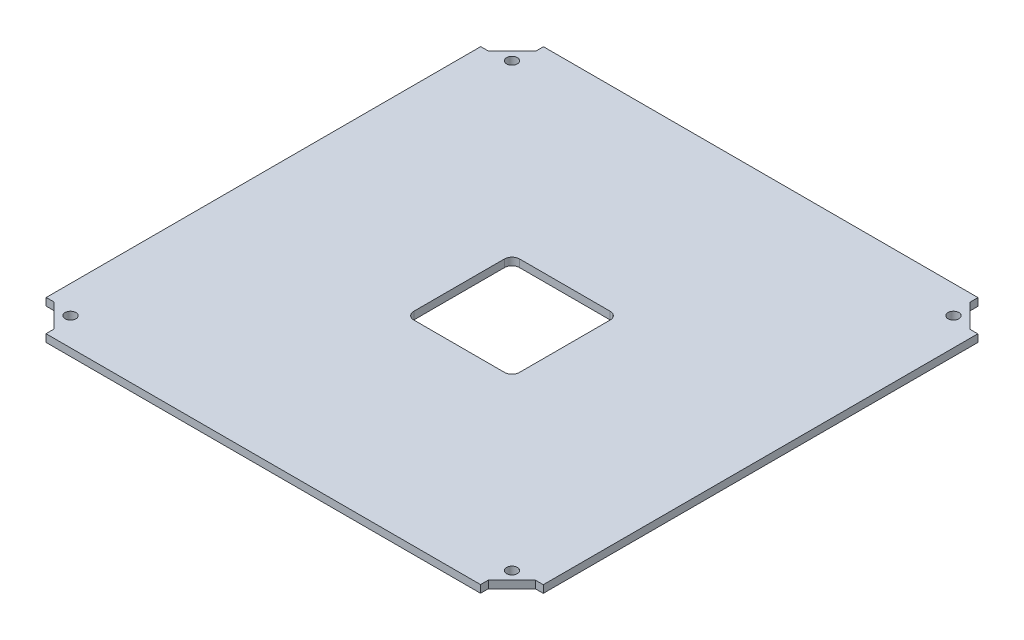
ISO-10303-21;
HEADER;
FILE_DESCRIPTION(('STEP AP214'),'2;1');
FILE_NAME('part.step','',(''),(''),'','','');
FILE_SCHEMA(('AUTOMOTIVE_DESIGN { 1 0 10303 214 1 1 1 1 }'));
ENDSEC;
DATA;
#1=APPLICATION_CONTEXT('core data for automotive mechanical design processes');
#2=APPLICATION_PROTOCOL_DEFINITION('international standard','automotive_design',2000,#1);
#3=PRODUCT_CONTEXT('',#1,'mechanical');
#4=PRODUCT('Part','Part','',(#3));
#5=PRODUCT_RELATED_PRODUCT_CATEGORY('part','',(#4));
#6=PRODUCT_DEFINITION_FORMATION('','',#4);
#7=PRODUCT_DEFINITION_CONTEXT('part definition',#1,'design');
#8=PRODUCT_DEFINITION('design','',#6,#7);
#9=PRODUCT_DEFINITION_SHAPE('','',#8);
#10=(LENGTH_UNIT() NAMED_UNIT(*) SI_UNIT(.MILLI.,.METRE.));
#11=(NAMED_UNIT(*) PLANE_ANGLE_UNIT() SI_UNIT($,.RADIAN.));
#12=(NAMED_UNIT(*) SI_UNIT($,.STERADIAN.) SOLID_ANGLE_UNIT());
#13=UNCERTAINTY_MEASURE_WITH_UNIT(LENGTH_MEASURE(1.E-05),#10,'distance_accuracy_value','');
#14=(GEOMETRIC_REPRESENTATION_CONTEXT(3) GLOBAL_UNCERTAINTY_ASSIGNED_CONTEXT((#13)) GLOBAL_UNIT_ASSIGNED_CONTEXT((#10,
#11,#12)) REPRESENTATION_CONTEXT('',''));
#15=CARTESIAN_POINT('',(0.,0.,0.));
#16=DIRECTION('',(0.,0.,1.));
#17=DIRECTION('',(1.,0.,0.));
#18=AXIS2_PLACEMENT_3D('',#15,#16,#17);
#19=CARTESIAN_POINT('',(0.,3.175,0.));
#20=DIRECTION('',(0.,1.,0.));
#21=DIRECTION('',(0.,0.,1.));
#22=AXIS2_PLACEMENT_3D('',#19,#20,#21);
#23=PLANE('',#22);
#24=CARTESIAN_POINT('',(-92.73413,3.175,92.73413));
#25=DIRECTION('',(0.,1.,0.));
#26=DIRECTION('',(0.,0.,1.));
#27=AXIS2_PLACEMENT_3D('',#24,#25,#26);
#28=CIRCLE('',#27,2.28599999999999);
#29=CARTESIAN_POINT('',(-92.73413,3.175,95.02013));
#30=VERTEX_POINT('',#29);
#31=EDGE_CURVE('E341',#30,#30,#28,.T.);
#32=ORIENTED_EDGE('',*,*,#31,.F.);
#33=EDGE_LOOP('',(#32));
#34=FACE_BOUND('',#33,.T.);
#35=CARTESIAN_POINT('',(92.73413,3.175,92.73413));
#36=DIRECTION('',(0.,1.,0.));
#37=DIRECTION('',(0.,0.,1.));
#38=AXIS2_PLACEMENT_3D('',#35,#36,#37);
#39=CIRCLE('',#38,2.28599999999999);
#40=CARTESIAN_POINT('',(92.73413,3.175,95.02013));
#41=VERTEX_POINT('',#40);
#42=EDGE_CURVE('E332',#41,#41,#39,.T.);
#43=ORIENTED_EDGE('',*,*,#42,.F.);
#44=EDGE_LOOP('',(#43));
#45=FACE_BOUND('',#44,.T.);
#46=CARTESIAN_POINT('',(92.73413,3.175,-92.73413));
#47=DIRECTION('',(0.,1.,0.));
#48=DIRECTION('',(0.,0.,1.));
#49=AXIS2_PLACEMENT_3D('',#46,#47,#48);
#50=CIRCLE('',#49,2.28599999999999);
#51=CARTESIAN_POINT('',(92.73413,3.175,-90.44813));
#52=VERTEX_POINT('',#51);
#53=EDGE_CURVE('E331',#52,#52,#50,.T.);
#54=ORIENTED_EDGE('',*,*,#53,.F.);
#55=EDGE_LOOP('',(#54));
#56=FACE_BOUND('',#55,.T.);
#57=CARTESIAN_POINT('',(-92.73413,3.175,-92.73413));
#58=DIRECTION('',(0.,1.,0.));
#59=DIRECTION('',(0.,0.,1.));
#60=AXIS2_PLACEMENT_3D('',#57,#58,#59);
#61=CIRCLE('',#60,2.28599999999999);
#62=CARTESIAN_POINT('',(-92.73413,3.175,-90.44813));
#63=VERTEX_POINT('',#62);
#64=EDGE_CURVE('E336',#63,#63,#61,.T.);
#65=ORIENTED_EDGE('',*,*,#64,.F.);
#66=EDGE_LOOP('',(#65));
#67=FACE_BOUND('',#66,.T.);
#68=DIRECTION('',(1.,0.,0.));
#69=VECTOR('',#68,1.);
#70=CARTESIAN_POINT('',(0.,3.175,91.2332677458592));
#71=LINE('',#70,#69);
#72=CARTESIAN_POINT('',(-104.4575,3.175,91.2332677458592));
#73=VERTEX_POINT('',#72);
#74=CARTESIAN_POINT('',(-101.1555,3.175,91.2332677458592));
#75=VERTEX_POINT('',#74);
#76=EDGE_CURVE('E216',#73,#75,#71,.T.);
#77=ORIENTED_EDGE('',*,*,#76,.T.);
#78=DIRECTION('',(0.703946656504847,0.,0.710252845679373));
#79=VECTOR('',#78,1.);
#80=CARTESIAN_POINT('',(-96.6436327647906,3.175,95.7855537941316));
#81=LINE('',#80,#79);
#82=CARTESIAN_POINT('',(-91.3213652086273,3.175,101.1555));
#83=VERTEX_POINT('',#82);
#84=EDGE_CURVE('E203',#75,#83,#81,.T.);
#85=ORIENTED_EDGE('',*,*,#84,.T.);
#86=DIRECTION('',(0.,0.,-1.));
#87=VECTOR('',#86,1.);
#88=CARTESIAN_POINT('',(-91.3213652086273,3.175,0.));
#89=LINE('',#88,#87);
#90=CARTESIAN_POINT('',(-91.3213652086273,3.175,104.4575));
#91=VERTEX_POINT('',#90);
#92=EDGE_CURVE('E215',#91,#83,#89,.T.);
#93=ORIENTED_EDGE('',*,*,#92,.F.);
#94=DIRECTION('',(1.,0.,0.));
#95=VECTOR('',#94,1.);
#96=CARTESIAN_POINT('',(0.,3.175,104.4575));
#97=LINE('',#96,#95);
#98=CARTESIAN_POINT('',(91.2332677458592,3.175,104.4575));
#99=VERTEX_POINT('',#98);
#100=EDGE_CURVE('E360',#91,#99,#97,.T.);
#101=ORIENTED_EDGE('',*,*,#100,.T.);
#102=DIRECTION('',(0.,0.,-1.));
#103=VECTOR('',#102,1.);
#104=CARTESIAN_POINT('',(91.2332677458592,3.175,0.));
#105=LINE('',#104,#103);
#106=CARTESIAN_POINT('',(91.2332677458592,3.175,101.1555));
#107=VERTEX_POINT('',#106);
#108=EDGE_CURVE('E363',#99,#107,#105,.T.);
#109=ORIENTED_EDGE('',*,*,#108,.T.);
#110=DIRECTION('',(0.710252845679373,0.,-0.703946656504847));
#111=VECTOR('',#110,1.);
#112=CARTESIAN_POINT('',(95.7855537941315,3.175,96.6436327647906));
#113=LINE('',#112,#111);
#114=CARTESIAN_POINT('',(101.1555,3.175,91.3213652086273));
#115=VERTEX_POINT('',#114);
#116=EDGE_CURVE('E366',#107,#115,#113,.T.);
#117=ORIENTED_EDGE('',*,*,#116,.T.);
#118=DIRECTION('',(-1.,0.,0.));
#119=VECTOR('',#118,1.);
#120=CARTESIAN_POINT('',(0.,3.175,91.3213652086273));
#121=LINE('',#120,#119);
#122=CARTESIAN_POINT('',(104.4575,3.175,91.3213652086273));
#123=VERTEX_POINT('',#122);
#124=EDGE_CURVE('E369',#123,#115,#121,.T.);
#125=ORIENTED_EDGE('',*,*,#124,.F.);
#126=DIRECTION('',(0.,0.,-1.));
#127=VECTOR('',#126,1.);
#128=CARTESIAN_POINT('',(104.4575,3.175,0.));
#129=LINE('',#128,#127);
#130=CARTESIAN_POINT('',(104.4575,3.175,-91.2332677458592));
#131=VERTEX_POINT('',#130);
#132=EDGE_CURVE('E373',#123,#131,#129,.T.);
#133=ORIENTED_EDGE('',*,*,#132,.T.);
#134=DIRECTION('',(-1.,0.,0.));
#135=VECTOR('',#134,1.);
#136=CARTESIAN_POINT('',(0.,3.175,-91.2332677458592));
#137=LINE('',#136,#135);
#138=CARTESIAN_POINT('',(101.1555,3.175,-91.2332677458592));
#139=VERTEX_POINT('',#138);
#140=EDGE_CURVE('E376',#131,#139,#137,.T.);
#141=ORIENTED_EDGE('',*,*,#140,.T.);
#142=DIRECTION('',(0.703946656504847,0.,0.710252845679373));
#143=VECTOR('',#142,1.);
#144=CARTESIAN_POINT('',(96.6436327647906,3.175,-95.7855537941315));
#145=LINE('',#144,#143);
#146=CARTESIAN_POINT('',(91.3213652086273,3.175,-101.1555));
#147=VERTEX_POINT('',#146);
#148=EDGE_CURVE('E379',#147,#139,#145,.T.);
#149=ORIENTED_EDGE('',*,*,#148,.F.);
#150=DIRECTION('',(0.,0.,1.));
#151=VECTOR('',#150,1.);
#152=CARTESIAN_POINT('',(91.3213652086273,3.175,0.));
#153=LINE('',#152,#151);
#154=CARTESIAN_POINT('',(91.3213652086273,3.175,-104.4575));
#155=VERTEX_POINT('',#154);
#156=EDGE_CURVE('E383',#155,#147,#153,.T.);
#157=ORIENTED_EDGE('',*,*,#156,.F.);
#158=DIRECTION('',(1.,0.,0.));
#159=VECTOR('',#158,1.);
#160=CARTESIAN_POINT('',(0.,3.175,-104.4575));
#161=LINE('',#160,#159);
#162=CARTESIAN_POINT('',(-91.2332677458592,3.175,-104.4575));
#163=VERTEX_POINT('',#162);
#164=EDGE_CURVE('E387',#163,#155,#161,.T.);
#165=ORIENTED_EDGE('',*,*,#164,.F.);
#166=DIRECTION('',(0.,0.,1.));
#167=VECTOR('',#166,1.);
#168=CARTESIAN_POINT('',(-91.2332677458592,3.175,0.));
#169=LINE('',#168,#167);
#170=CARTESIAN_POINT('',(-91.2332677458592,3.175,-101.1555));
#171=VERTEX_POINT('',#170);
#172=EDGE_CURVE('E391',#163,#171,#169,.T.);
#173=ORIENTED_EDGE('',*,*,#172,.T.);
#174=DIRECTION('',(0.710252845679373,0.,-0.703946656504847));
#175=VECTOR('',#174,1.);
#176=CARTESIAN_POINT('',(-95.7855537941315,3.175,-96.6436327647906));
#177=LINE('',#176,#175);
#178=CARTESIAN_POINT('',(-101.1555,3.175,-91.3213652086273));
#179=VERTEX_POINT('',#178);
#180=EDGE_CURVE('E394',#179,#171,#177,.T.);
#181=ORIENTED_EDGE('',*,*,#180,.F.);
#182=DIRECTION('',(1.,0.,0.));
#183=VECTOR('',#182,1.);
#184=CARTESIAN_POINT('',(0.,3.175,-91.3213652086273));
#185=LINE('',#184,#183);
#186=CARTESIAN_POINT('',(-104.4575,3.175,-91.3213652086273));
#187=VERTEX_POINT('',#186);
#188=EDGE_CURVE('E398',#187,#179,#185,.T.);
#189=ORIENTED_EDGE('',*,*,#188,.F.);
#190=DIRECTION('',(0.,0.,-1.));
#191=VECTOR('',#190,1.);
#192=CARTESIAN_POINT('',(-104.4575,3.175,0.));
#193=LINE('',#192,#191);
#194=EDGE_CURVE('E223',#73,#187,#193,.T.);
#195=ORIENTED_EDGE('',*,*,#194,.F.);
#196=EDGE_LOOP('',(#77,#85,#93,#101,#109,#117,#125,#133,#141,#149,#157,#165,#173,#181,#189,#195));
#197=FACE_BOUND('',#196,.T.);
#198=DIRECTION('',(0.,0.,-1.));
#199=VECTOR('',#198,1.);
#200=CARTESIAN_POINT('',(22.225,3.175,0.));
#201=LINE('',#200,#199);
#202=CARTESIAN_POINT('',(22.225,3.175,19.05));
#203=VERTEX_POINT('',#202);
#204=CARTESIAN_POINT('',(22.225,3.175,-19.05));
#205=VERTEX_POINT('',#204);
#206=EDGE_CURVE('E286',#203,#205,#201,.T.);
#207=ORIENTED_EDGE('',*,*,#206,.F.);
#208=CARTESIAN_POINT('',(19.05,3.175,19.05));
#209=DIRECTION('',(0.,1.,0.));
#210=DIRECTION('',(0.,0.,1.));
#211=AXIS2_PLACEMENT_3D('',#208,#209,#210);
#212=CIRCLE('',#211,3.175);
#213=CARTESIAN_POINT('',(19.05,3.175,22.225));
#214=VERTEX_POINT('',#213);
#215=EDGE_CURVE('E49',#203,#214,#212,.F.);
#216=ORIENTED_EDGE('',*,*,#215,.T.);
#217=DIRECTION('',(-1.,0.,0.));
#218=VECTOR('',#217,1.);
#219=CARTESIAN_POINT('',(0.,3.175,22.225));
#220=LINE('',#219,#218);
#221=CARTESIAN_POINT('',(-19.05,3.175,22.225));
#222=VERTEX_POINT('',#221);
#223=EDGE_CURVE('E284',#214,#222,#220,.T.);
#224=ORIENTED_EDGE('',*,*,#223,.T.);
#225=CARTESIAN_POINT('',(-19.05,3.175,19.05));
#226=DIRECTION('',(0.,1.,0.));
#227=DIRECTION('',(0.,0.,1.));
#228=AXIS2_PLACEMENT_3D('',#225,#226,#227);
#229=CIRCLE('',#228,3.175);
#230=CARTESIAN_POINT('',(-22.225,3.175,19.05));
#231=VERTEX_POINT('',#230);
#232=EDGE_CURVE('E277',#222,#231,#229,.F.);
#233=ORIENTED_EDGE('',*,*,#232,.T.);
#234=DIRECTION('',(0.,0.,-1.));
#235=VECTOR('',#234,1.);
#236=CARTESIAN_POINT('',(-22.225,3.175,0.));
#237=LINE('',#236,#235);
#238=CARTESIAN_POINT('',(-22.225,3.175,-19.05));
#239=VERTEX_POINT('',#238);
#240=EDGE_CURVE('E292',#231,#239,#237,.T.);
#241=ORIENTED_EDGE('',*,*,#240,.T.);
#242=CARTESIAN_POINT('',(-19.05,3.175,-19.05));
#243=DIRECTION('',(0.,1.,0.));
#244=DIRECTION('',(0.,0.,1.));
#245=AXIS2_PLACEMENT_3D('',#242,#243,#244);
#246=CIRCLE('',#245,3.175);
#247=CARTESIAN_POINT('',(-19.05,3.175,-22.225));
#248=VERTEX_POINT('',#247);
#249=EDGE_CURVE('E271',#239,#248,#246,.F.);
#250=ORIENTED_EDGE('',*,*,#249,.T.);
#251=DIRECTION('',(-1.,0.,0.));
#252=VECTOR('',#251,1.);
#253=CARTESIAN_POINT('',(0.,3.175,-22.225));
#254=LINE('',#253,#252);
#255=CARTESIAN_POINT('',(19.05,3.175,-22.225));
#256=VERTEX_POINT('',#255);
#257=EDGE_CURVE('E320',#256,#248,#254,.T.);
#258=ORIENTED_EDGE('',*,*,#257,.F.);
#259=CARTESIAN_POINT('',(19.05,3.175,-19.05));
#260=DIRECTION('',(0.,1.,0.));
#261=DIRECTION('',(0.,0.,1.));
#262=AXIS2_PLACEMENT_3D('',#259,#260,#261);
#263=CIRCLE('',#262,3.175);
#264=EDGE_CURVE('E265',#256,#205,#263,.F.);
#265=ORIENTED_EDGE('',*,*,#264,.T.);
#266=EDGE_LOOP('',(#207,#216,#224,#233,#241,#250,#258,#265));
#267=FACE_BOUND('',#266,.T.);
#268=ADVANCED_FACE('F40',(#34,#45,#56,#67,#197,#267),#23,.T.);
#269=CARTESIAN_POINT('',(0.,0.,0.));
#270=DIRECTION('',(0.,1.,0.));
#271=DIRECTION('',(0.,0.,1.));
#272=AXIS2_PLACEMENT_3D('',#269,#270,#271);
#273=PLANE('',#272);
#274=DIRECTION('',(1.,0.,0.));
#275=VECTOR('',#274,1.);
#276=CARTESIAN_POINT('',(0.,0.,91.2332677458592));
#277=LINE('',#276,#275);
#278=CARTESIAN_POINT('',(-104.4575,0.,91.2332677458592));
#279=VERTEX_POINT('',#278);
#280=CARTESIAN_POINT('',(-101.1555,0.,91.2332677458592));
#281=VERTEX_POINT('',#280);
#282=EDGE_CURVE('E230',#279,#281,#277,.T.);
#283=ORIENTED_EDGE('',*,*,#282,.F.);
#284=DIRECTION('',(0.,0.,-1.));
#285=VECTOR('',#284,1.);
#286=CARTESIAN_POINT('',(-104.4575,0.,0.));
#287=LINE('',#286,#285);
#288=CARTESIAN_POINT('',(-104.4575,0.,-91.3213652086273));
#289=VERTEX_POINT('',#288);
#290=EDGE_CURVE('E226',#279,#289,#287,.T.);
#291=ORIENTED_EDGE('',*,*,#290,.T.);
#292=DIRECTION('',(1.,0.,0.));
#293=VECTOR('',#292,1.);
#294=CARTESIAN_POINT('',(0.,0.,-91.3213652086273));
#295=LINE('',#294,#293);
#296=CARTESIAN_POINT('',(-101.1555,0.,-91.3213652086273));
#297=VERTEX_POINT('',#296);
#298=EDGE_CURVE('E455',#289,#297,#295,.T.);
#299=ORIENTED_EDGE('',*,*,#298,.T.);
#300=DIRECTION('',(0.710252845679373,0.,-0.703946656504847));
#301=VECTOR('',#300,1.);
#302=CARTESIAN_POINT('',(-95.7855537941315,0.,-96.6436327647906));
#303=LINE('',#302,#301);
#304=CARTESIAN_POINT('',(-91.2332677458592,0.,-101.1555));
#305=VERTEX_POINT('',#304);
#306=EDGE_CURVE('E451',#297,#305,#303,.T.);
#307=ORIENTED_EDGE('',*,*,#306,.T.);
#308=DIRECTION('',(0.,0.,1.));
#309=VECTOR('',#308,1.);
#310=CARTESIAN_POINT('',(-91.2332677458592,0.,0.));
#311=LINE('',#310,#309);
#312=CARTESIAN_POINT('',(-91.2332677458592,0.,-104.4575));
#313=VERTEX_POINT('',#312);
#314=EDGE_CURVE('E447',#313,#305,#311,.T.);
#315=ORIENTED_EDGE('',*,*,#314,.F.);
#316=DIRECTION('',(1.,0.,0.));
#317=VECTOR('',#316,1.);
#318=CARTESIAN_POINT('',(0.,0.,-104.4575));
#319=LINE('',#318,#317);
#320=CARTESIAN_POINT('',(91.3213652086273,0.,-104.4575));
#321=VERTEX_POINT('',#320);
#322=EDGE_CURVE('E443',#313,#321,#319,.T.);
#323=ORIENTED_EDGE('',*,*,#322,.T.);
#324=DIRECTION('',(0.,0.,1.));
#325=VECTOR('',#324,1.);
#326=CARTESIAN_POINT('',(91.3213652086273,0.,0.));
#327=LINE('',#326,#325);
#328=CARTESIAN_POINT('',(91.3213652086273,0.,-101.1555));
#329=VERTEX_POINT('',#328);
#330=EDGE_CURVE('E439',#321,#329,#327,.T.);
#331=ORIENTED_EDGE('',*,*,#330,.T.);
#332=DIRECTION('',(0.703946656504847,0.,0.710252845679373));
#333=VECTOR('',#332,1.);
#334=CARTESIAN_POINT('',(96.6436327647906,0.,-95.7855537941315));
#335=LINE('',#334,#333);
#336=CARTESIAN_POINT('',(101.1555,0.,-91.2332677458592));
#337=VERTEX_POINT('',#336);
#338=EDGE_CURVE('E435',#329,#337,#335,.T.);
#339=ORIENTED_EDGE('',*,*,#338,.T.);
#340=DIRECTION('',(-1.,0.,0.));
#341=VECTOR('',#340,1.);
#342=CARTESIAN_POINT('',(0.,0.,-91.2332677458592));
#343=LINE('',#342,#341);
#344=CARTESIAN_POINT('',(104.4575,0.,-91.2332677458592));
#345=VERTEX_POINT('',#344);
#346=EDGE_CURVE('E431',#345,#337,#343,.T.);
#347=ORIENTED_EDGE('',*,*,#346,.F.);
#348=DIRECTION('',(0.,0.,-1.));
#349=VECTOR('',#348,1.);
#350=CARTESIAN_POINT('',(104.4575,0.,0.));
#351=LINE('',#350,#349);
#352=CARTESIAN_POINT('',(104.4575,0.,91.3213652086273));
#353=VERTEX_POINT('',#352);
#354=EDGE_CURVE('E428',#353,#345,#351,.T.);
#355=ORIENTED_EDGE('',*,*,#354,.F.);
#356=DIRECTION('',(-1.,0.,0.));
#357=VECTOR('',#356,1.);
#358=CARTESIAN_POINT('',(0.,0.,91.3213652086273));
#359=LINE('',#358,#357);
#360=CARTESIAN_POINT('',(101.1555,0.,91.3213652086273));
#361=VERTEX_POINT('',#360);
#362=EDGE_CURVE('E424',#353,#361,#359,.T.);
#363=ORIENTED_EDGE('',*,*,#362,.T.);
#364=DIRECTION('',(0.710252845679373,0.,-0.703946656504847));
#365=VECTOR('',#364,1.);
#366=CARTESIAN_POINT('',(95.7855537941315,0.,96.6436327647906));
#367=LINE('',#366,#365);
#368=CARTESIAN_POINT('',(91.2332677458592,0.,101.1555));
#369=VERTEX_POINT('',#368);
#370=EDGE_CURVE('E420',#369,#361,#367,.T.);
#371=ORIENTED_EDGE('',*,*,#370,.F.);
#372=DIRECTION('',(0.,0.,-1.));
#373=VECTOR('',#372,1.);
#374=CARTESIAN_POINT('',(91.2332677458592,0.,0.));
#375=LINE('',#374,#373);
#376=CARTESIAN_POINT('',(91.2332677458592,0.,104.4575));
#377=VERTEX_POINT('',#376);
#378=EDGE_CURVE('E417',#377,#369,#375,.T.);
#379=ORIENTED_EDGE('',*,*,#378,.F.);
#380=DIRECTION('',(1.,0.,0.));
#381=VECTOR('',#380,1.);
#382=CARTESIAN_POINT('',(0.,0.,104.4575));
#383=LINE('',#382,#381);
#384=CARTESIAN_POINT('',(-91.3213652086273,0.,104.4575));
#385=VERTEX_POINT('',#384);
#386=EDGE_CURVE('E414',#385,#377,#383,.T.);
#387=ORIENTED_EDGE('',*,*,#386,.F.);
#388=DIRECTION('',(0.,0.,-1.));
#389=VECTOR('',#388,1.);
#390=CARTESIAN_POINT('',(-91.3213652086273,0.,0.));
#391=LINE('',#390,#389);
#392=CARTESIAN_POINT('',(-91.3213652086273,0.,101.1555));
#393=VERTEX_POINT('',#392);
#394=EDGE_CURVE('E410',#385,#393,#391,.T.);
#395=ORIENTED_EDGE('',*,*,#394,.T.);
#396=DIRECTION('',(0.703946656504847,0.,0.710252845679373));
#397=VECTOR('',#396,1.);
#398=CARTESIAN_POINT('',(-96.6436327647906,0.,95.7855537941316));
#399=LINE('',#398,#397);
#400=EDGE_CURVE('E407',#281,#393,#399,.T.);
#401=ORIENTED_EDGE('',*,*,#400,.F.);
#402=EDGE_LOOP('',(#283,#291,#299,#307,#315,#323,#331,#339,#347,#355,#363,#371,#379,#387,#395,#401));
#403=FACE_BOUND('',#402,.T.);
#404=CARTESIAN_POINT('',(-92.73413,0.,-92.73413));
#405=DIRECTION('',(0.,1.,0.));
#406=DIRECTION('',(0.,0.,1.));
#407=AXIS2_PLACEMENT_3D('',#404,#405,#406);
#408=CIRCLE('',#407,2.28599999999999);
#409=CARTESIAN_POINT('',(-92.73413,0.,-90.44813));
#410=VERTEX_POINT('',#409);
#411=EDGE_CURVE('E354',#410,#410,#408,.F.);
#412=ORIENTED_EDGE('',*,*,#411,.F.);
#413=EDGE_LOOP('',(#412));
#414=FACE_BOUND('',#413,.T.);
#415=CARTESIAN_POINT('',(92.73413,0.,-92.73413));
#416=DIRECTION('',(0.,1.,0.));
#417=DIRECTION('',(0.,0.,1.));
#418=AXIS2_PLACEMENT_3D('',#415,#416,#417);
#419=CIRCLE('',#418,2.28599999999999);
#420=CARTESIAN_POINT('',(92.73413,0.,-90.44813));
#421=VERTEX_POINT('',#420);
#422=EDGE_CURVE('E327',#421,#421,#419,.F.);
#423=ORIENTED_EDGE('',*,*,#422,.F.);
#424=EDGE_LOOP('',(#423));
#425=FACE_BOUND('',#424,.T.);
#426=CARTESIAN_POINT('',(92.73413,0.,92.73413));
#427=DIRECTION('',(0.,1.,0.));
#428=DIRECTION('',(0.,0.,1.));
#429=AXIS2_PLACEMENT_3D('',#426,#427,#428);
#430=CIRCLE('',#429,2.28599999999999);
#431=CARTESIAN_POINT('',(92.73413,0.,95.02013));
#432=VERTEX_POINT('',#431);
#433=EDGE_CURVE('E337',#432,#432,#430,.F.);
#434=ORIENTED_EDGE('',*,*,#433,.F.);
#435=EDGE_LOOP('',(#434));
#436=FACE_BOUND('',#435,.T.);
#437=CARTESIAN_POINT('',(-92.73413,0.,92.73413));
#438=DIRECTION('',(0.,1.,0.));
#439=DIRECTION('',(0.,0.,1.));
#440=AXIS2_PLACEMENT_3D('',#437,#438,#439);
#441=CIRCLE('',#440,2.28599999999999);
#442=CARTESIAN_POINT('',(-92.73413,0.,95.02013));
#443=VERTEX_POINT('',#442);
#444=EDGE_CURVE('E326',#443,#443,#441,.F.);
#445=ORIENTED_EDGE('',*,*,#444,.F.);
#446=EDGE_LOOP('',(#445));
#447=FACE_BOUND('',#446,.T.);
#448=DIRECTION('',(1.,0.,0.));
#449=VECTOR('',#448,1.);
#450=CARTESIAN_POINT('',(0.,0.,-22.225));
#451=LINE('',#450,#449);
#452=CARTESIAN_POINT('',(-19.05,0.,-22.225));
#453=VERTEX_POINT('',#452);
#454=CARTESIAN_POINT('',(19.05,0.,-22.225));
#455=VERTEX_POINT('',#454);
#456=EDGE_CURVE('E306',#453,#455,#451,.T.);
#457=ORIENTED_EDGE('',*,*,#456,.F.);
#458=CARTESIAN_POINT('',(-19.05,0.,-19.05));
#459=DIRECTION('',(0.,1.,0.));
#460=DIRECTION('',(0.,0.,1.));
#461=AXIS2_PLACEMENT_3D('',#458,#459,#460);
#462=CIRCLE('',#461,3.175);
#463=CARTESIAN_POINT('',(-22.225,0.,-19.05));
#464=VERTEX_POINT('',#463);
#465=EDGE_CURVE('E274',#453,#464,#462,.T.);
#466=ORIENTED_EDGE('',*,*,#465,.T.);
#467=DIRECTION('',(0.,0.,1.));
#468=VECTOR('',#467,1.);
#469=CARTESIAN_POINT('',(-22.225,0.,0.));
#470=LINE('',#469,#468);
#471=CARTESIAN_POINT('',(-22.225,0.,19.05));
#472=VERTEX_POINT('',#471);
#473=EDGE_CURVE('E310',#464,#472,#470,.T.);
#474=ORIENTED_EDGE('',*,*,#473,.T.);
#475=CARTESIAN_POINT('',(-19.05,0.,19.05));
#476=DIRECTION('',(0.,1.,0.));
#477=DIRECTION('',(0.,0.,1.));
#478=AXIS2_PLACEMENT_3D('',#475,#476,#477);
#479=CIRCLE('',#478,3.175);
#480=CARTESIAN_POINT('',(-19.05,0.,22.225));
#481=VERTEX_POINT('',#480);
#482=EDGE_CURVE('E63',#472,#481,#479,.T.);
#483=ORIENTED_EDGE('',*,*,#482,.T.);
#484=DIRECTION('',(1.,0.,0.));
#485=VECTOR('',#484,1.);
#486=CARTESIAN_POINT('',(0.,0.,22.225));
#487=LINE('',#486,#485);
#488=CARTESIAN_POINT('',(19.05,0.,22.225));
#489=VERTEX_POINT('',#488);
#490=EDGE_CURVE('E301',#481,#489,#487,.T.);
#491=ORIENTED_EDGE('',*,*,#490,.T.);
#492=CARTESIAN_POINT('',(19.05,0.,19.05));
#493=DIRECTION('',(0.,1.,0.));
#494=DIRECTION('',(0.,0.,1.));
#495=AXIS2_PLACEMENT_3D('',#492,#493,#494);
#496=CIRCLE('',#495,3.175);
#497=CARTESIAN_POINT('',(22.225,0.,19.05));
#498=VERTEX_POINT('',#497);
#499=EDGE_CURVE('E11',#489,#498,#496,.T.);
#500=ORIENTED_EDGE('',*,*,#499,.T.);
#501=DIRECTION('',(0.,0.,1.));
#502=VECTOR('',#501,1.);
#503=CARTESIAN_POINT('',(22.225,0.,0.));
#504=LINE('',#503,#502);
#505=CARTESIAN_POINT('',(22.225,0.,-19.05));
#506=VERTEX_POINT('',#505);
#507=EDGE_CURVE('E299',#506,#498,#504,.T.);
#508=ORIENTED_EDGE('',*,*,#507,.F.);
#509=CARTESIAN_POINT('',(19.05,0.,-19.05));
#510=DIRECTION('',(0.,1.,0.));
#511=DIRECTION('',(0.,0.,1.));
#512=AXIS2_PLACEMENT_3D('',#509,#510,#511);
#513=CIRCLE('',#512,3.175);
#514=EDGE_CURVE('E268',#506,#455,#513,.T.);
#515=ORIENTED_EDGE('',*,*,#514,.T.);
#516=EDGE_LOOP('',(#457,#466,#474,#483,#491,#500,#508,#515));
#517=FACE_BOUND('',#516,.T.);
#518=ADVANCED_FACE('F298',(#403,#414,#425,#436,#447,#517),#273,.F.);
#519=CARTESIAN_POINT('',(0.,3.175,91.2332677458592));
#520=DIRECTION('',(0.,0.,-1.));
#521=DIRECTION('',(-1.,0.,0.));
#522=AXIS2_PLACEMENT_3D('',#519,#520,#521);
#523=PLANE('',#522);
#524=ORIENTED_EDGE('',*,*,#282,.T.);
#525=DIRECTION('',(0.,-1.,0.));
#526=VECTOR('',#525,1.);
#527=CARTESIAN_POINT('',(-101.1555,3.175,91.2332677458592));
#528=LINE('',#527,#526);
#529=EDGE_CURVE('E208',#75,#281,#528,.T.);
#530=ORIENTED_EDGE('',*,*,#529,.F.);
#531=ORIENTED_EDGE('',*,*,#76,.F.);
#532=DIRECTION('',(0.,-1.,0.));
#533=VECTOR('',#532,1.);
#534=CARTESIAN_POINT('',(-104.4575,3.175,91.2332677458592));
#535=LINE('',#534,#533);
#536=EDGE_CURVE('E404',#73,#279,#535,.T.);
#537=ORIENTED_EDGE('',*,*,#536,.T.);
#538=EDGE_LOOP('',(#524,#530,#531,#537));
#539=FACE_BOUND('',#538,.T.);
#540=ADVANCED_FACE('F228',(#539),#523,.F.);
#541=CARTESIAN_POINT('',(-96.6436327647906,3.175,95.7855537941316));
#542=DIRECTION('',(0.710252845679373,0.,-0.703946656504847));
#543=DIRECTION('',(-0.703946656504847,0.,-0.710252845679373));
#544=AXIS2_PLACEMENT_3D('',#541,#542,#543);
#545=PLANE('',#544);
#546=ORIENTED_EDGE('',*,*,#400,.T.);
#547=DIRECTION('',(0.,-1.,0.));
#548=VECTOR('',#547,1.);
#549=CARTESIAN_POINT('',(-91.3213652086273,3.175,101.1555));
#550=LINE('',#549,#548);
#551=EDGE_CURVE('E210',#83,#393,#550,.T.);
#552=ORIENTED_EDGE('',*,*,#551,.F.);
#553=ORIENTED_EDGE('',*,*,#84,.F.);
#554=ORIENTED_EDGE('',*,*,#529,.T.);
#555=EDGE_LOOP('',(#546,#552,#553,#554));
#556=FACE_BOUND('',#555,.T.);
#557=ADVANCED_FACE('F206',(#556),#545,.F.);
#558=CARTESIAN_POINT('',(-91.3213652086273,3.175,0.));
#559=DIRECTION('',(-1.,0.,0.));
#560=DIRECTION('',(0.,0.,1.));
#561=AXIS2_PLACEMENT_3D('',#558,#559,#560);
#562=PLANE('',#561);
#563=ORIENTED_EDGE('',*,*,#394,.F.);
#564=DIRECTION('',(0.,-1.,0.));
#565=VECTOR('',#564,1.);
#566=CARTESIAN_POINT('',(-91.3213652086273,3.175,104.4575));
#567=LINE('',#566,#565);
#568=EDGE_CURVE('E238',#91,#385,#567,.T.);
#569=ORIENTED_EDGE('',*,*,#568,.F.);
#570=ORIENTED_EDGE('',*,*,#92,.T.);
#571=ORIENTED_EDGE('',*,*,#551,.T.);
#572=EDGE_LOOP('',(#563,#569,#570,#571));
#573=FACE_BOUND('',#572,.T.);
#574=ADVANCED_FACE('F514',(#573),#562,.T.);
#575=CARTESIAN_POINT('',(0.,3.175,104.4575));
#576=DIRECTION('',(0.,0.,-1.));
#577=DIRECTION('',(-1.,0.,0.));
#578=AXIS2_PLACEMENT_3D('',#575,#576,#577);
#579=PLANE('',#578);
#580=ORIENTED_EDGE('',*,*,#386,.T.);
#581=DIRECTION('',(0.,-1.,0.));
#582=VECTOR('',#581,1.);
#583=CARTESIAN_POINT('',(91.2332677458592,3.175,104.4575));
#584=LINE('',#583,#582);
#585=EDGE_CURVE('E499',#99,#377,#584,.T.);
#586=ORIENTED_EDGE('',*,*,#585,.F.);
#587=ORIENTED_EDGE('',*,*,#100,.F.);
#588=ORIENTED_EDGE('',*,*,#568,.T.);
#589=EDGE_LOOP('',(#580,#586,#587,#588));
#590=FACE_BOUND('',#589,.T.);
#591=ADVANCED_FACE('F506',(#590),#579,.F.);
#592=CARTESIAN_POINT('',(91.2332677458592,3.175,0.));
#593=DIRECTION('',(-1.,0.,0.));
#594=DIRECTION('',(0.,0.,1.));
#595=AXIS2_PLACEMENT_3D('',#592,#593,#594);
#596=PLANE('',#595);
#597=ORIENTED_EDGE('',*,*,#378,.T.);
#598=DIRECTION('',(0.,-1.,0.));
#599=VECTOR('',#598,1.);
#600=CARTESIAN_POINT('',(91.2332677458592,3.175,101.1555));
#601=LINE('',#600,#599);
#602=EDGE_CURVE('E495',#107,#369,#601,.T.);
#603=ORIENTED_EDGE('',*,*,#602,.F.);
#604=ORIENTED_EDGE('',*,*,#108,.F.);
#605=ORIENTED_EDGE('',*,*,#585,.T.);
#606=EDGE_LOOP('',(#597,#603,#604,#605));
#607=FACE_BOUND('',#606,.T.);
#608=ADVANCED_FACE('F562',(#607),#596,.F.);
#609=CARTESIAN_POINT('',(95.7855537941315,3.175,96.6436327647906));
#610=DIRECTION('',(-0.703946656504847,0.,-0.710252845679373));
#611=DIRECTION('',(-0.710252845679373,0.,0.703946656504847));
#612=AXIS2_PLACEMENT_3D('',#609,#610,#611);
#613=PLANE('',#612);
#614=ORIENTED_EDGE('',*,*,#370,.T.);
#615=DIRECTION('',(0.,-1.,0.));
#616=VECTOR('',#615,1.);
#617=CARTESIAN_POINT('',(101.1555,3.175,91.3213652086273));
#618=LINE('',#617,#616);
#619=EDGE_CURVE('E492',#115,#361,#618,.T.);
#620=ORIENTED_EDGE('',*,*,#619,.F.);
#621=ORIENTED_EDGE('',*,*,#116,.F.);
#622=ORIENTED_EDGE('',*,*,#602,.T.);
#623=EDGE_LOOP('',(#614,#620,#621,#622));
#624=FACE_BOUND('',#623,.T.);
#625=ADVANCED_FACE('F558',(#624),#613,.F.);
#626=CARTESIAN_POINT('',(0.,3.175,91.3213652086273));
#627=DIRECTION('',(0.,0.,1.));
#628=DIRECTION('',(1.,0.,0.));
#629=AXIS2_PLACEMENT_3D('',#626,#627,#628);
#630=PLANE('',#629);
#631=ORIENTED_EDGE('',*,*,#362,.F.);
#632=DIRECTION('',(0.,-1.,0.));
#633=VECTOR('',#632,1.);
#634=CARTESIAN_POINT('',(104.4575,3.175,91.3213652086273));
#635=LINE('',#634,#633);
#636=EDGE_CURVE('E489',#123,#353,#635,.T.);
#637=ORIENTED_EDGE('',*,*,#636,.F.);
#638=ORIENTED_EDGE('',*,*,#124,.T.);
#639=ORIENTED_EDGE('',*,*,#619,.T.);
#640=EDGE_LOOP('',(#631,#637,#638,#639));
#641=FACE_BOUND('',#640,.T.);
#642=ADVANCED_FACE('F552',(#641),#630,.T.);
#643=CARTESIAN_POINT('',(104.4575,3.175,0.));
#644=DIRECTION('',(-1.,0.,0.));
#645=DIRECTION('',(0.,0.,1.));
#646=AXIS2_PLACEMENT_3D('',#643,#644,#645);
#647=PLANE('',#646);
#648=ORIENTED_EDGE('',*,*,#354,.T.);
#649=DIRECTION('',(0.,-1.,0.));
#650=VECTOR('',#649,1.);
#651=CARTESIAN_POINT('',(104.4575,3.175,-91.2332677458592));
#652=LINE('',#651,#650);
#653=EDGE_CURVE('E485',#131,#345,#652,.T.);
#654=ORIENTED_EDGE('',*,*,#653,.F.);
#655=ORIENTED_EDGE('',*,*,#132,.F.);
#656=ORIENTED_EDGE('',*,*,#636,.T.);
#657=EDGE_LOOP('',(#648,#654,#655,#656));
#658=FACE_BOUND('',#657,.T.);
#659=ADVANCED_FACE('F563',(#658),#647,.F.);
#660=CARTESIAN_POINT('',(0.,3.175,-91.2332677458592));
#661=DIRECTION('',(0.,0.,1.));
#662=DIRECTION('',(1.,0.,0.));
#663=AXIS2_PLACEMENT_3D('',#660,#661,#662);
#664=PLANE('',#663);
#665=ORIENTED_EDGE('',*,*,#346,.T.);
#666=DIRECTION('',(0.,-1.,0.));
#667=VECTOR('',#666,1.);
#668=CARTESIAN_POINT('',(101.1555,3.175,-91.2332677458592));
#669=LINE('',#668,#667);
#670=EDGE_CURVE('E482',#139,#337,#669,.T.);
#671=ORIENTED_EDGE('',*,*,#670,.F.);
#672=ORIENTED_EDGE('',*,*,#140,.F.);
#673=ORIENTED_EDGE('',*,*,#653,.T.);
#674=EDGE_LOOP('',(#665,#671,#672,#673));
#675=FACE_BOUND('',#674,.T.);
#676=ADVANCED_FACE('F546',(#675),#664,.F.);
#677=CARTESIAN_POINT('',(96.6436327647906,3.175,-95.7855537941315));
#678=DIRECTION('',(0.710252845679373,0.,-0.703946656504847));
#679=DIRECTION('',(-0.703946656504847,0.,-0.710252845679373));
#680=AXIS2_PLACEMENT_3D('',#677,#678,#679);
#681=PLANE('',#680);
#682=ORIENTED_EDGE('',*,*,#338,.F.);
#683=DIRECTION('',(0.,-1.,0.));
#684=VECTOR('',#683,1.);
#685=CARTESIAN_POINT('',(91.3213652086273,3.175,-101.1555));
#686=LINE('',#685,#684);
#687=EDGE_CURVE('E479',#147,#329,#686,.T.);
#688=ORIENTED_EDGE('',*,*,#687,.F.);
#689=ORIENTED_EDGE('',*,*,#148,.T.);
#690=ORIENTED_EDGE('',*,*,#670,.T.);
#691=EDGE_LOOP('',(#682,#688,#689,#690));
#692=FACE_BOUND('',#691,.T.);
#693=ADVANCED_FACE('F542',(#692),#681,.T.);
#694=CARTESIAN_POINT('',(91.3213652086273,3.175,0.));
#695=DIRECTION('',(1.,0.,0.));
#696=DIRECTION('',(0.,0.,-1.));
#697=AXIS2_PLACEMENT_3D('',#694,#695,#696);
#698=PLANE('',#697);
#699=ORIENTED_EDGE('',*,*,#330,.F.);
#700=DIRECTION('',(0.,-1.,0.));
#701=VECTOR('',#700,1.);
#702=CARTESIAN_POINT('',(91.3213652086273,3.175,-104.4575));
#703=LINE('',#702,#701);
#704=EDGE_CURVE('E476',#155,#321,#703,.T.);
#705=ORIENTED_EDGE('',*,*,#704,.F.);
#706=ORIENTED_EDGE('',*,*,#156,.T.);
#707=ORIENTED_EDGE('',*,*,#687,.T.);
#708=EDGE_LOOP('',(#699,#705,#706,#707));
#709=FACE_BOUND('',#708,.T.);
#710=ADVANCED_FACE('F538',(#709),#698,.T.);
#711=CARTESIAN_POINT('',(0.,3.175,-104.4575));
#712=DIRECTION('',(0.,0.,-1.));
#713=DIRECTION('',(-1.,0.,0.));
#714=AXIS2_PLACEMENT_3D('',#711,#712,#713);
#715=PLANE('',#714);
#716=ORIENTED_EDGE('',*,*,#322,.F.);
#717=DIRECTION('',(0.,-1.,0.));
#718=VECTOR('',#717,1.);
#719=CARTESIAN_POINT('',(-91.2332677458592,3.175,-104.4575));
#720=LINE('',#719,#718);
#721=EDGE_CURVE('E473',#163,#313,#720,.T.);
#722=ORIENTED_EDGE('',*,*,#721,.F.);
#723=ORIENTED_EDGE('',*,*,#164,.T.);
#724=ORIENTED_EDGE('',*,*,#704,.T.);
#725=EDGE_LOOP('',(#716,#722,#723,#724));
#726=FACE_BOUND('',#725,.T.);
#727=ADVANCED_FACE('F533',(#726),#715,.T.);
#728=CARTESIAN_POINT('',(-91.2332677458592,3.175,0.));
#729=DIRECTION('',(1.,0.,0.));
#730=DIRECTION('',(0.,0.,-1.));
#731=AXIS2_PLACEMENT_3D('',#728,#729,#730);
#732=PLANE('',#731);
#733=ORIENTED_EDGE('',*,*,#314,.T.);
#734=DIRECTION('',(0.,-1.,0.));
#735=VECTOR('',#734,1.);
#736=CARTESIAN_POINT('',(-91.2332677458592,3.175,-101.1555));
#737=LINE('',#736,#735);
#738=EDGE_CURVE('E470',#171,#305,#737,.T.);
#739=ORIENTED_EDGE('',*,*,#738,.F.);
#740=ORIENTED_EDGE('',*,*,#172,.F.);
#741=ORIENTED_EDGE('',*,*,#721,.T.);
#742=EDGE_LOOP('',(#733,#739,#740,#741));
#743=FACE_BOUND('',#742,.T.);
#744=ADVANCED_FACE('F530',(#743),#732,.F.);
#745=CARTESIAN_POINT('',(-95.7855537941315,3.175,-96.6436327647906));
#746=DIRECTION('',(-0.703946656504847,0.,-0.710252845679373));
#747=DIRECTION('',(-0.710252845679373,0.,0.703946656504847));
#748=AXIS2_PLACEMENT_3D('',#745,#746,#747);
#749=PLANE('',#748);
#750=ORIENTED_EDGE('',*,*,#306,.F.);
#751=DIRECTION('',(0.,-1.,0.));
#752=VECTOR('',#751,1.);
#753=CARTESIAN_POINT('',(-101.1555,3.175,-91.3213652086273));
#754=LINE('',#753,#752);
#755=EDGE_CURVE('E467',#179,#297,#754,.T.);
#756=ORIENTED_EDGE('',*,*,#755,.F.);
#757=ORIENTED_EDGE('',*,*,#180,.T.);
#758=ORIENTED_EDGE('',*,*,#738,.T.);
#759=EDGE_LOOP('',(#750,#756,#757,#758));
#760=FACE_BOUND('',#759,.T.);
#761=ADVANCED_FACE('F525',(#760),#749,.T.);
#762=CARTESIAN_POINT('',(0.,3.175,-91.3213652086273));
#763=DIRECTION('',(0.,0.,-1.));
#764=DIRECTION('',(-1.,0.,0.));
#765=AXIS2_PLACEMENT_3D('',#762,#763,#764);
#766=PLANE('',#765);
#767=ORIENTED_EDGE('',*,*,#298,.F.);
#768=DIRECTION('',(0.,-1.,0.));
#769=VECTOR('',#768,1.);
#770=CARTESIAN_POINT('',(-104.4575,3.175,-91.3213652086273));
#771=LINE('',#770,#769);
#772=EDGE_CURVE('E464',#187,#289,#771,.T.);
#773=ORIENTED_EDGE('',*,*,#772,.F.);
#774=ORIENTED_EDGE('',*,*,#188,.T.);
#775=ORIENTED_EDGE('',*,*,#755,.T.);
#776=EDGE_LOOP('',(#767,#773,#774,#775));
#777=FACE_BOUND('',#776,.T.);
#778=ADVANCED_FACE('F520',(#777),#766,.T.);
#779=CARTESIAN_POINT('',(-104.4575,3.175,0.));
#780=DIRECTION('',(-1.,0.,0.));
#781=DIRECTION('',(0.,0.,1.));
#782=AXIS2_PLACEMENT_3D('',#779,#780,#781);
#783=PLANE('',#782);
#784=ORIENTED_EDGE('',*,*,#290,.F.);
#785=ORIENTED_EDGE('',*,*,#536,.F.);
#786=ORIENTED_EDGE('',*,*,#194,.T.);
#787=ORIENTED_EDGE('',*,*,#772,.T.);
#788=EDGE_LOOP('',(#784,#785,#786,#787));
#789=FACE_BOUND('',#788,.T.);
#790=ADVANCED_FACE('F517',(#789),#783,.T.);
#791=CARTESIAN_POINT('',(-92.73413,-0.00100000000000013,-92.73413));
#792=DIRECTION('',(0.,1.,0.));
#793=DIRECTION('',(0.,0.,1.));
#794=AXIS2_PLACEMENT_3D('',#791,#792,#793);
#795=CYLINDRICAL_SURFACE('',#794,2.28599999999999);
#796=ORIENTED_EDGE('',*,*,#64,.T.);
#797=EDGE_LOOP('',(#796));
#798=FACE_BOUND('',#797,.T.);
#799=ORIENTED_EDGE('',*,*,#411,.T.);
#800=EDGE_LOOP('',(#799));
#801=FACE_BOUND('',#800,.T.);
#802=ADVANCED_FACE('F583',(#798,#801),#795,.F.);
#803=CARTESIAN_POINT('',(92.73413,-0.00100000000000013,-92.73413));
#804=DIRECTION('',(0.,1.,0.));
#805=DIRECTION('',(0.,0.,1.));
#806=AXIS2_PLACEMENT_3D('',#803,#804,#805);
#807=CYLINDRICAL_SURFACE('',#806,2.28599999999999);
#808=ORIENTED_EDGE('',*,*,#53,.T.);
#809=EDGE_LOOP('',(#808));
#810=FACE_BOUND('',#809,.T.);
#811=ORIENTED_EDGE('',*,*,#422,.T.);
#812=EDGE_LOOP('',(#811));
#813=FACE_BOUND('',#812,.T.);
#814=ADVANCED_FACE('F633',(#810,#813),#807,.F.);
#815=CARTESIAN_POINT('',(92.73413,-0.00100000000000013,92.73413));
#816=DIRECTION('',(0.,1.,0.));
#817=DIRECTION('',(0.,0.,1.));
#818=AXIS2_PLACEMENT_3D('',#815,#816,#817);
#819=CYLINDRICAL_SURFACE('',#818,2.28599999999999);
#820=ORIENTED_EDGE('',*,*,#42,.T.);
#821=EDGE_LOOP('',(#820));
#822=FACE_BOUND('',#821,.T.);
#823=ORIENTED_EDGE('',*,*,#433,.T.);
#824=EDGE_LOOP('',(#823));
#825=FACE_BOUND('',#824,.T.);
#826=ADVANCED_FACE('F640',(#822,#825),#819,.F.);
#827=CARTESIAN_POINT('',(-92.73413,-0.00100000000000013,92.73413));
#828=DIRECTION('',(0.,1.,0.));
#829=DIRECTION('',(0.,0.,1.));
#830=AXIS2_PLACEMENT_3D('',#827,#828,#829);
#831=CYLINDRICAL_SURFACE('',#830,2.28599999999999);
#832=ORIENTED_EDGE('',*,*,#31,.T.);
#833=EDGE_LOOP('',(#832));
#834=FACE_BOUND('',#833,.T.);
#835=ORIENTED_EDGE('',*,*,#444,.T.);
#836=EDGE_LOOP('',(#835));
#837=FACE_BOUND('',#836,.T.);
#838=ADVANCED_FACE('F648',(#834,#837),#831,.F.);
#839=CARTESIAN_POINT('',(-22.225,-0.00100000000000013,0.));
#840=DIRECTION('',(1.,0.,0.));
#841=DIRECTION('',(0.,0.,-1.));
#842=AXIS2_PLACEMENT_3D('',#839,#840,#841);
#843=PLANE('',#842);
#844=ORIENTED_EDGE('',*,*,#473,.F.);
#845=DIRECTION('',(0.,1.,0.));
#846=VECTOR('',#845,1.);
#847=CARTESIAN_POINT('',(-22.225,-0.00100000000000013,-19.05));
#848=LINE('',#847,#846);
#849=EDGE_CURVE('E255',#464,#239,#848,.T.);
#850=ORIENTED_EDGE('',*,*,#849,.T.);
#851=ORIENTED_EDGE('',*,*,#240,.F.);
#852=DIRECTION('',(0.,1.,0.));
#853=VECTOR('',#852,1.);
#854=CARTESIAN_POINT('',(-22.225,0.,19.05));
#855=LINE('',#854,#853);
#856=EDGE_CURVE('E252',#231,#472,#855,.F.);
#857=ORIENTED_EDGE('',*,*,#856,.T.);
#858=EDGE_LOOP('',(#844,#850,#851,#857));
#859=FACE_BOUND('',#858,.T.);
#860=ADVANCED_FACE('F655',(#859),#843,.T.);
#861=CARTESIAN_POINT('',(0.,-0.00100000000000013,-22.225));
#862=DIRECTION('',(0.,0.,-1.));
#863=DIRECTION('',(-1.,0.,0.));
#864=AXIS2_PLACEMENT_3D('',#861,#862,#863);
#865=PLANE('',#864);
#866=ORIENTED_EDGE('',*,*,#456,.T.);
#867=DIRECTION('',(0.,1.,0.));
#868=VECTOR('',#867,1.);
#869=CARTESIAN_POINT('',(19.05,3.175,-22.225));
#870=LINE('',#869,#868);
#871=EDGE_CURVE('E236',#455,#256,#870,.T.);
#872=ORIENTED_EDGE('',*,*,#871,.T.);
#873=ORIENTED_EDGE('',*,*,#257,.T.);
#874=DIRECTION('',(0.,1.,0.));
#875=VECTOR('',#874,1.);
#876=CARTESIAN_POINT('',(-19.05,-0.00100000000000013,-22.225));
#877=LINE('',#876,#875);
#878=EDGE_CURVE('E232',#248,#453,#877,.F.);
#879=ORIENTED_EDGE('',*,*,#878,.T.);
#880=EDGE_LOOP('',(#866,#872,#873,#879));
#881=FACE_BOUND('',#880,.T.);
#882=ADVANCED_FACE('F675',(#881),#865,.F.);
#883=CARTESIAN_POINT('',(22.225,-0.00100000000000013,0.));
#884=DIRECTION('',(1.,0.,0.));
#885=DIRECTION('',(0.,0.,-1.));
#886=AXIS2_PLACEMENT_3D('',#883,#884,#885);
#887=PLANE('',#886);
#888=ORIENTED_EDGE('',*,*,#206,.T.);
#889=DIRECTION('',(0.,1.,0.));
#890=VECTOR('',#889,1.);
#891=CARTESIAN_POINT('',(22.225,0.,-19.05));
#892=LINE('',#891,#890);
#893=EDGE_CURVE('E249',#205,#506,#892,.F.);
#894=ORIENTED_EDGE('',*,*,#893,.T.);
#895=ORIENTED_EDGE('',*,*,#507,.T.);
#896=DIRECTION('',(0.,1.,0.));
#897=VECTOR('',#896,1.);
#898=CARTESIAN_POINT('',(22.225,-0.00100000000000013,19.05));
#899=LINE('',#898,#897);
#900=EDGE_CURVE('E245',#498,#203,#899,.T.);
#901=ORIENTED_EDGE('',*,*,#900,.T.);
#902=EDGE_LOOP('',(#888,#894,#895,#901));
#903=FACE_BOUND('',#902,.T.);
#904=ADVANCED_FACE('F303',(#903),#887,.F.);
#905=CARTESIAN_POINT('',(0.,-0.00100000000000013,22.225));
#906=DIRECTION('',(0.,0.,-1.));
#907=DIRECTION('',(-1.,0.,0.));
#908=AXIS2_PLACEMENT_3D('',#905,#906,#907);
#909=PLANE('',#908);
#910=ORIENTED_EDGE('',*,*,#490,.F.);
#911=DIRECTION('',(0.,1.,0.));
#912=VECTOR('',#911,1.);
#913=CARTESIAN_POINT('',(-19.05,3.175,22.225));
#914=LINE('',#913,#912);
#915=EDGE_CURVE('E261',#481,#222,#914,.T.);
#916=ORIENTED_EDGE('',*,*,#915,.T.);
#917=ORIENTED_EDGE('',*,*,#223,.F.);
#918=DIRECTION('',(0.,1.,0.));
#919=VECTOR('',#918,1.);
#920=CARTESIAN_POINT('',(19.05,-0.00100000000000013,22.225));
#921=LINE('',#920,#919);
#922=EDGE_CURVE('E56',#214,#489,#921,.F.);
#923=ORIENTED_EDGE('',*,*,#922,.T.);
#924=EDGE_LOOP('',(#910,#916,#917,#923));
#925=FACE_BOUND('',#924,.T.);
#926=ADVANCED_FACE('F289',(#925),#909,.T.);
#927=CARTESIAN_POINT('',(19.05,-0.00100000000000013,-19.05));
#928=DIRECTION('',(0.,-1.,0.));
#929=DIRECTION('',(0.,0.,-1.));
#930=AXIS2_PLACEMENT_3D('',#927,#928,#929);
#931=CYLINDRICAL_SURFACE('',#930,3.175);
#932=ORIENTED_EDGE('',*,*,#514,.F.);
#933=ORIENTED_EDGE('',*,*,#893,.F.);
#934=ORIENTED_EDGE('',*,*,#264,.F.);
#935=ORIENTED_EDGE('',*,*,#871,.F.);
#936=EDGE_LOOP('',(#932,#933,#934,#935));
#937=FACE_BOUND('',#936,.T.);
#938=ADVANCED_FACE('F696',(#937),#931,.F.);
#939=CARTESIAN_POINT('',(-19.05,-0.00100000000000013,-19.05));
#940=DIRECTION('',(0.,1.,0.));
#941=DIRECTION('',(0.,0.,1.));
#942=AXIS2_PLACEMENT_3D('',#939,#940,#941);
#943=CYLINDRICAL_SURFACE('',#942,3.175);
#944=ORIENTED_EDGE('',*,*,#465,.F.);
#945=ORIENTED_EDGE('',*,*,#878,.F.);
#946=ORIENTED_EDGE('',*,*,#249,.F.);
#947=ORIENTED_EDGE('',*,*,#849,.F.);
#948=EDGE_LOOP('',(#944,#945,#946,#947));
#949=FACE_BOUND('',#948,.T.);
#950=ADVANCED_FACE('F703',(#949),#943,.F.);
#951=CARTESIAN_POINT('',(-19.05,-0.00100000000000013,19.05));
#952=DIRECTION('',(0.,-1.,0.));
#953=DIRECTION('',(0.,0.,-1.));
#954=AXIS2_PLACEMENT_3D('',#951,#952,#953);
#955=CYLINDRICAL_SURFACE('',#954,3.175);
#956=ORIENTED_EDGE('',*,*,#482,.F.);
#957=ORIENTED_EDGE('',*,*,#856,.F.);
#958=ORIENTED_EDGE('',*,*,#232,.F.);
#959=ORIENTED_EDGE('',*,*,#915,.F.);
#960=EDGE_LOOP('',(#956,#957,#958,#959));
#961=FACE_BOUND('',#960,.T.);
#962=ADVANCED_FACE('F711',(#961),#955,.F.);
#963=CARTESIAN_POINT('',(19.05,-0.00100000000000013,19.05));
#964=DIRECTION('',(0.,1.,0.));
#965=DIRECTION('',(0.,0.,1.));
#966=AXIS2_PLACEMENT_3D('',#963,#964,#965);
#967=CYLINDRICAL_SURFACE('',#966,3.175);
#968=ORIENTED_EDGE('',*,*,#499,.F.);
#969=ORIENTED_EDGE('',*,*,#922,.F.);
#970=ORIENTED_EDGE('',*,*,#215,.F.);
#971=ORIENTED_EDGE('',*,*,#900,.F.);
#972=EDGE_LOOP('',(#968,#969,#970,#971));
#973=FACE_BOUND('',#972,.T.);
#974=ADVANCED_FACE('F42',(#973),#967,.F.);
#975=CLOSED_SHELL('',(#268,#518,#540,#557,#574,#591,#608,#625,#642,#659,#676,#693,#710,#727,
#744,#761,#778,#790,#802,#814,#826,#838,#860,#882,#904,#926,#938,#950,#962,#974));
#976=MANIFOLD_SOLID_BREP('B2',#975);
#977=ADVANCED_BREP_SHAPE_REPRESENTATION('',(#18,#976),#14);
#978=SHAPE_DEFINITION_REPRESENTATION(#9,#977);
ENDSEC;
END-ISO-10303-21;
